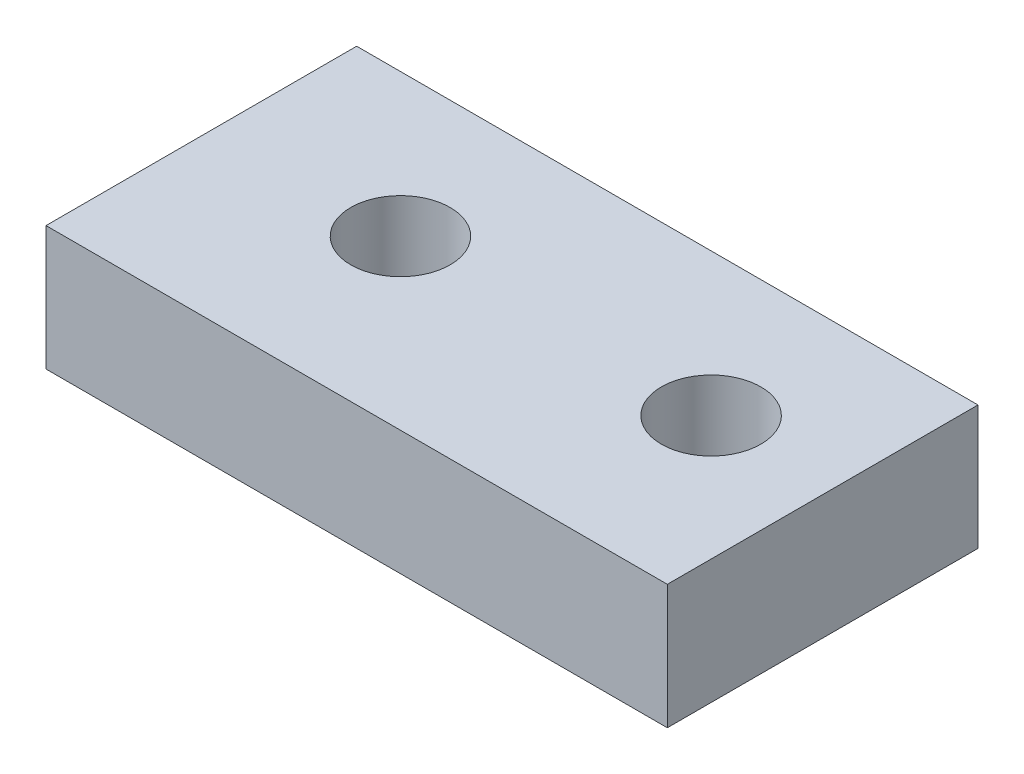
ISO-10303-21;
HEADER;
FILE_DESCRIPTION(('STEP AP214'),'2;1');
FILE_NAME('part.step','',(''),(''),'','','');
FILE_SCHEMA(('AUTOMOTIVE_DESIGN { 1 0 10303 214 1 1 1 1 }'));
ENDSEC;
DATA;
#1=APPLICATION_CONTEXT('core data for automotive mechanical design processes');
#2=APPLICATION_PROTOCOL_DEFINITION('international standard','automotive_design',2000,#1);
#3=PRODUCT_CONTEXT('',#1,'mechanical');
#4=PRODUCT('Part','Part','',(#3));
#5=PRODUCT_RELATED_PRODUCT_CATEGORY('part','',(#4));
#6=PRODUCT_DEFINITION_FORMATION('','',#4);
#7=PRODUCT_DEFINITION_CONTEXT('part definition',#1,'design');
#8=PRODUCT_DEFINITION('design','',#6,#7);
#9=PRODUCT_DEFINITION_SHAPE('','',#8);
#10=(LENGTH_UNIT() NAMED_UNIT(*) SI_UNIT(.MILLI.,.METRE.));
#11=(NAMED_UNIT(*) PLANE_ANGLE_UNIT() SI_UNIT($,.RADIAN.));
#12=(NAMED_UNIT(*) SI_UNIT($,.STERADIAN.) SOLID_ANGLE_UNIT());
#13=UNCERTAINTY_MEASURE_WITH_UNIT(LENGTH_MEASURE(1.E-05),#10,'distance_accuracy_value','');
#14=(GEOMETRIC_REPRESENTATION_CONTEXT(3) GLOBAL_UNCERTAINTY_ASSIGNED_CONTEXT((#13)) GLOBAL_UNIT_ASSIGNED_CONTEXT((#10,
#11,#12)) REPRESENTATION_CONTEXT('',''));
#15=CARTESIAN_POINT('',(0.,0.,0.));
#16=DIRECTION('',(0.,0.,1.));
#17=DIRECTION('',(1.,0.,0.));
#18=AXIS2_PLACEMENT_3D('',#15,#16,#17);
#19=CARTESIAN_POINT('',(0.,2.,0.));
#20=DIRECTION('',(0.,1.,0.));
#21=DIRECTION('',(0.,0.,1.));
#22=AXIS2_PLACEMENT_3D('',#19,#20,#21);
#23=PLANE('',#22);
#24=CARTESIAN_POINT('',(-0.76956463200052,2.,0.));
#25=DIRECTION('',(0.,1.,0.));
#26=DIRECTION('',(0.,0.,1.));
#27=AXIS2_PLACEMENT_3D('',#24,#25,#26);
#28=CIRCLE('',#27,0.800000000000001);
#29=CARTESIAN_POINT('',(-0.76956463200052,2.,0.800000000000002));
#30=VERTEX_POINT('',#29);
#31=EDGE_CURVE('E100',#30,#30,#28,.T.);
#32=ORIENTED_EDGE('',*,*,#31,.F.);
#33=EDGE_LOOP('',(#32));
#34=FACE_BOUND('',#33,.T.);
#35=DIRECTION('',(0.,0.,1.));
#36=VECTOR('',#35,1.);
#37=CARTESIAN_POINT('',(-3.76956463200052,2.,-2.29543260116771));
#38=LINE('',#37,#36);
#39=CARTESIAN_POINT('',(-3.76956463200052,2.,-2.29543260116771));
#40=VERTEX_POINT('',#39);
#41=CARTESIAN_POINT('',(-3.76956463200052,2.,2.70456739883229));
#42=VERTEX_POINT('',#41);
#43=EDGE_CURVE('E85',#40,#42,#38,.T.);
#44=ORIENTED_EDGE('',*,*,#43,.T.);
#45=DIRECTION('',(1.,0.,0.));
#46=VECTOR('',#45,1.);
#47=CARTESIAN_POINT('',(-3.76956463200052,2.,2.70456739883229));
#48=LINE('',#47,#46);
#49=CARTESIAN_POINT('',(6.23043536799948,2.,2.70456739883229));
#50=VERTEX_POINT('',#49);
#51=EDGE_CURVE('E80',#42,#50,#48,.T.);
#52=ORIENTED_EDGE('',*,*,#51,.T.);
#53=DIRECTION('',(0.,0.,-1.));
#54=VECTOR('',#53,1.);
#55=CARTESIAN_POINT('',(6.23043536799948,2.,-2.29543260116771));
#56=LINE('',#55,#54);
#57=CARTESIAN_POINT('',(6.23043536799948,2.,-2.29543260116771));
#58=VERTEX_POINT('',#57);
#59=EDGE_CURVE('E83',#50,#58,#56,.T.);
#60=ORIENTED_EDGE('',*,*,#59,.T.);
#61=DIRECTION('',(-1.,0.,0.));
#62=VECTOR('',#61,1.);
#63=CARTESIAN_POINT('',(-3.76956463200052,2.,-2.29543260116771));
#64=LINE('',#63,#62);
#65=EDGE_CURVE('E50',#58,#40,#64,.T.);
#66=ORIENTED_EDGE('',*,*,#65,.T.);
#67=EDGE_LOOP('',(#44,#52,#60,#66));
#68=FACE_BOUND('',#67,.T.);
#69=CARTESIAN_POINT('',(4.23043536799948,2.,0.));
#70=DIRECTION('',(0.,1.,0.));
#71=DIRECTION('',(0.,0.,1.));
#72=AXIS2_PLACEMENT_3D('',#69,#70,#71);
#73=CIRCLE('',#72,0.800000000000001);
#74=CARTESIAN_POINT('',(4.23043536799948,2.,0.800000000000002));
#75=VERTEX_POINT('',#74);
#76=EDGE_CURVE('E115',#75,#75,#73,.T.);
#77=ORIENTED_EDGE('',*,*,#76,.F.);
#78=EDGE_LOOP('',(#77));
#79=FACE_BOUND('',#78,.T.);
#80=ADVANCED_FACE('F33',(#34,#68,#79),#23,.T.);
#81=CARTESIAN_POINT('',(0.,0.,0.));
#82=DIRECTION('',(0.,1.,0.));
#83=DIRECTION('',(0.,0.,1.));
#84=AXIS2_PLACEMENT_3D('',#81,#82,#83);
#85=PLANE('',#84);
#86=DIRECTION('',(0.,0.,1.));
#87=VECTOR('',#86,1.);
#88=CARTESIAN_POINT('',(-3.76956463200052,0.,-2.29543260116771));
#89=LINE('',#88,#87);
#90=CARTESIAN_POINT('',(-3.76956463200052,0.,-2.29543260116771));
#91=VERTEX_POINT('',#90);
#92=CARTESIAN_POINT('',(-3.76956463200052,0.,2.70456739883229));
#93=VERTEX_POINT('',#92);
#94=EDGE_CURVE('E97',#91,#93,#89,.T.);
#95=ORIENTED_EDGE('',*,*,#94,.F.);
#96=DIRECTION('',(-1.,0.,0.));
#97=VECTOR('',#96,1.);
#98=CARTESIAN_POINT('',(-3.76956463200052,0.,-2.29543260116771));
#99=LINE('',#98,#97);
#100=CARTESIAN_POINT('',(6.23043536799948,0.,-2.29543260116771));
#101=VERTEX_POINT('',#100);
#102=EDGE_CURVE('E73',#101,#91,#99,.T.);
#103=ORIENTED_EDGE('',*,*,#102,.F.);
#104=DIRECTION('',(0.,0.,-1.));
#105=VECTOR('',#104,1.);
#106=CARTESIAN_POINT('',(6.23043536799948,0.,-2.29543260116771));
#107=LINE('',#106,#105);
#108=CARTESIAN_POINT('',(6.23043536799948,0.,2.70456739883229));
#109=VERTEX_POINT('',#108);
#110=EDGE_CURVE('E67',#109,#101,#107,.T.);
#111=ORIENTED_EDGE('',*,*,#110,.F.);
#112=DIRECTION('',(1.,0.,0.));
#113=VECTOR('',#112,1.);
#114=CARTESIAN_POINT('',(-3.76956463200052,0.,2.70456739883229));
#115=LINE('',#114,#113);
#116=EDGE_CURVE('E89',#93,#109,#115,.T.);
#117=ORIENTED_EDGE('',*,*,#116,.F.);
#118=EDGE_LOOP('',(#95,#103,#111,#117));
#119=FACE_BOUND('',#118,.T.);
#120=CARTESIAN_POINT('',(-0.76956463200052,0.,0.));
#121=DIRECTION('',(0.,1.,0.));
#122=DIRECTION('',(0.,0.,1.));
#123=AXIS2_PLACEMENT_3D('',#120,#121,#122);
#124=CIRCLE('',#123,0.800000000000001);
#125=CARTESIAN_POINT('',(-0.76956463200052,0.,0.800000000000002));
#126=VERTEX_POINT('',#125);
#127=EDGE_CURVE('E112',#126,#126,#124,.T.);
#128=ORIENTED_EDGE('',*,*,#127,.T.);
#129=EDGE_LOOP('',(#128));
#130=FACE_BOUND('',#129,.T.);
#131=CARTESIAN_POINT('',(4.23043536799948,0.,0.));
#132=DIRECTION('',(0.,1.,0.));
#133=DIRECTION('',(0.,0.,1.));
#134=AXIS2_PLACEMENT_3D('',#131,#132,#133);
#135=CIRCLE('',#134,0.800000000000001);
#136=CARTESIAN_POINT('',(4.23043536799948,0.,0.800000000000002));
#137=VERTEX_POINT('',#136);
#138=EDGE_CURVE('E118',#137,#137,#135,.T.);
#139=ORIENTED_EDGE('',*,*,#138,.T.);
#140=EDGE_LOOP('',(#139));
#141=FACE_BOUND('',#140,.T.);
#142=ADVANCED_FACE('F108',(#119,#130,#141),#85,.F.);
#143=CARTESIAN_POINT('',(-3.76956463200052,2.,-2.29543260116771));
#144=DIRECTION('',(1.,0.,0.));
#145=DIRECTION('',(0.,0.,-1.));
#146=AXIS2_PLACEMENT_3D('',#143,#144,#145);
#147=PLANE('',#146);
#148=ORIENTED_EDGE('',*,*,#94,.T.);
#149=DIRECTION('',(0.,-1.,0.));
#150=VECTOR('',#149,1.);
#151=CARTESIAN_POINT('',(-3.76956463200052,2.,2.70456739883229));
#152=LINE('',#151,#150);
#153=EDGE_CURVE('E11',#42,#93,#152,.T.);
#154=ORIENTED_EDGE('',*,*,#153,.F.);
#155=ORIENTED_EDGE('',*,*,#43,.F.);
#156=DIRECTION('',(0.,-1.,0.));
#157=VECTOR('',#156,1.);
#158=CARTESIAN_POINT('',(-3.76956463200052,2.,-2.29543260116771));
#159=LINE('',#158,#157);
#160=EDGE_CURVE('E93',#40,#91,#159,.T.);
#161=ORIENTED_EDGE('',*,*,#160,.T.);
#162=EDGE_LOOP('',(#148,#154,#155,#161));
#163=FACE_BOUND('',#162,.T.);
#164=ADVANCED_FACE('F35',(#163),#147,.F.);
#165=CARTESIAN_POINT('',(-3.76956463200052,2.,2.70456739883229));
#166=DIRECTION('',(0.,0.,-1.));
#167=DIRECTION('',(-1.,0.,0.));
#168=AXIS2_PLACEMENT_3D('',#165,#166,#167);
#169=PLANE('',#168);
#170=ORIENTED_EDGE('',*,*,#116,.T.);
#171=DIRECTION('',(0.,-1.,0.));
#172=VECTOR('',#171,1.);
#173=CARTESIAN_POINT('',(6.23043536799948,2.,2.70456739883229));
#174=LINE('',#173,#172);
#175=EDGE_CURVE('E42',#50,#109,#174,.T.);
#176=ORIENTED_EDGE('',*,*,#175,.F.);
#177=ORIENTED_EDGE('',*,*,#51,.F.);
#178=ORIENTED_EDGE('',*,*,#153,.T.);
#179=EDGE_LOOP('',(#170,#176,#177,#178));
#180=FACE_BOUND('',#179,.T.);
#181=ADVANCED_FACE('F88',(#180),#169,.F.);
#182=CARTESIAN_POINT('',(6.23043536799948,2.,-2.29543260116771));
#183=DIRECTION('',(-1.,0.,0.));
#184=DIRECTION('',(0.,0.,1.));
#185=AXIS2_PLACEMENT_3D('',#182,#183,#184);
#186=PLANE('',#185);
#187=ORIENTED_EDGE('',*,*,#110,.T.);
#188=DIRECTION('',(0.,-1.,0.));
#189=VECTOR('',#188,1.);
#190=CARTESIAN_POINT('',(6.23043536799948,2.,-2.29543260116771));
#191=LINE('',#190,#189);
#192=EDGE_CURVE('E90',#58,#101,#191,.T.);
#193=ORIENTED_EDGE('',*,*,#192,.F.);
#194=ORIENTED_EDGE('',*,*,#59,.F.);
#195=ORIENTED_EDGE('',*,*,#175,.T.);
#196=EDGE_LOOP('',(#187,#193,#194,#195));
#197=FACE_BOUND('',#196,.T.);
#198=ADVANCED_FACE('F91',(#197),#186,.F.);
#199=CARTESIAN_POINT('',(-3.76956463200052,2.,-2.29543260116771));
#200=DIRECTION('',(0.,0.,1.));
#201=DIRECTION('',(1.,0.,0.));
#202=AXIS2_PLACEMENT_3D('',#199,#200,#201);
#203=PLANE('',#202);
#204=ORIENTED_EDGE('',*,*,#102,.T.);
#205=ORIENTED_EDGE('',*,*,#160,.F.);
#206=ORIENTED_EDGE('',*,*,#65,.F.);
#207=ORIENTED_EDGE('',*,*,#192,.T.);
#208=EDGE_LOOP('',(#204,#205,#206,#207));
#209=FACE_BOUND('',#208,.T.);
#210=ADVANCED_FACE('F105',(#209),#203,.F.);
#211=CARTESIAN_POINT('',(-0.76956463200052,2.,0.));
#212=DIRECTION('',(0.,-1.,0.));
#213=DIRECTION('',(0.,0.,-1.));
#214=AXIS2_PLACEMENT_3D('',#211,#212,#213);
#215=CYLINDRICAL_SURFACE('',#214,0.800000000000001);
#216=ORIENTED_EDGE('',*,*,#31,.T.);
#217=EDGE_LOOP('',(#216));
#218=FACE_BOUND('',#217,.T.);
#219=ORIENTED_EDGE('',*,*,#127,.F.);
#220=EDGE_LOOP('',(#219));
#221=FACE_BOUND('',#220,.T.);
#222=ADVANCED_FACE('F135',(#218,#221),#215,.F.);
#223=CARTESIAN_POINT('',(4.23043536799948,2.,0.));
#224=DIRECTION('',(0.,-1.,0.));
#225=DIRECTION('',(0.,0.,-1.));
#226=AXIS2_PLACEMENT_3D('',#223,#224,#225);
#227=CYLINDRICAL_SURFACE('',#226,0.800000000000001);
#228=ORIENTED_EDGE('',*,*,#76,.T.);
#229=EDGE_LOOP('',(#228));
#230=FACE_BOUND('',#229,.T.);
#231=ORIENTED_EDGE('',*,*,#138,.F.);
#232=EDGE_LOOP('',(#231));
#233=FACE_BOUND('',#232,.T.);
#234=ADVANCED_FACE('F124',(#230,#233),#227,.F.);
#235=CLOSED_SHELL('',(#80,#142,#164,#181,#198,#210,#222,#234));
#236=MANIFOLD_SOLID_BREP('B2',#235);
#237=ADVANCED_BREP_SHAPE_REPRESENTATION('',(#18,#236),#14);
#238=SHAPE_DEFINITION_REPRESENTATION(#9,#237);
ENDSEC;
END-ISO-10303-21;
